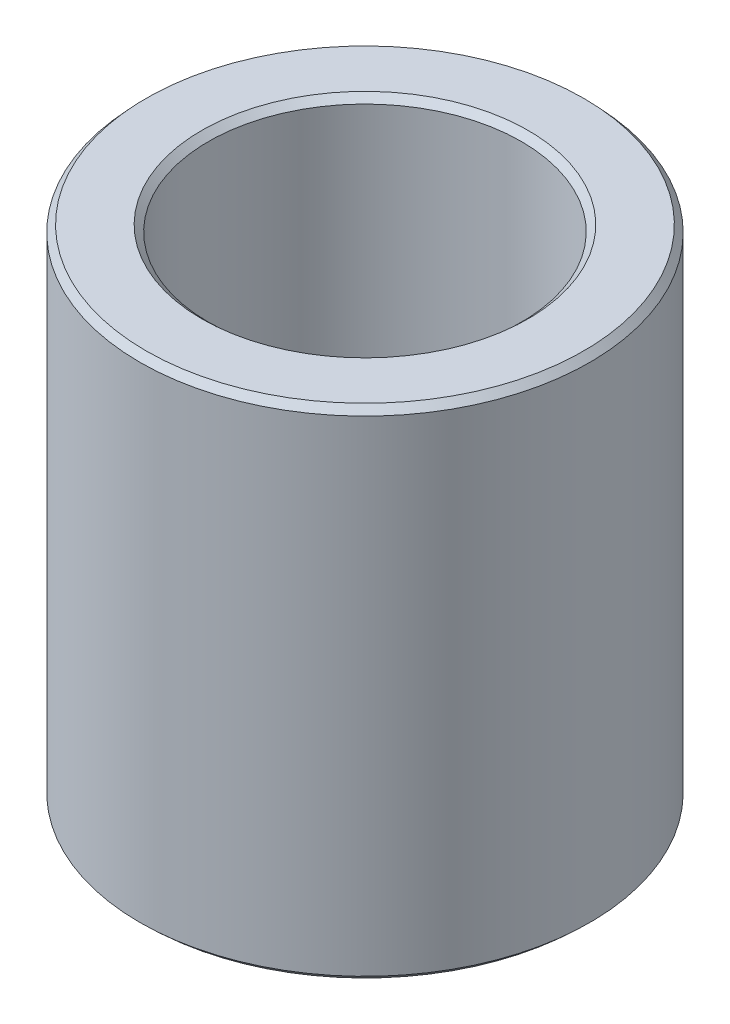
ISO-10303-21;
HEADER;
FILE_DESCRIPTION(('STEP AP214'),'2;1');
FILE_NAME('part.step','',(''),(''),'','','');
FILE_SCHEMA(('AUTOMOTIVE_DESIGN { 1 0 10303 214 1 1 1 1 }'));
ENDSEC;
DATA;
#1=APPLICATION_CONTEXT('core data for automotive mechanical design processes');
#2=APPLICATION_PROTOCOL_DEFINITION('international standard','automotive_design',2000,#1);
#3=PRODUCT_CONTEXT('',#1,'mechanical');
#4=PRODUCT('Part','Part','',(#3));
#5=PRODUCT_RELATED_PRODUCT_CATEGORY('part','',(#4));
#6=PRODUCT_DEFINITION_FORMATION('','',#4);
#7=PRODUCT_DEFINITION_CONTEXT('part definition',#1,'design');
#8=PRODUCT_DEFINITION('design','',#6,#7);
#9=PRODUCT_DEFINITION_SHAPE('','',#8);
#10=(LENGTH_UNIT() NAMED_UNIT(*) SI_UNIT(.MILLI.,.METRE.));
#11=(NAMED_UNIT(*) PLANE_ANGLE_UNIT() SI_UNIT($,.RADIAN.));
#12=(NAMED_UNIT(*) SI_UNIT($,.STERADIAN.) SOLID_ANGLE_UNIT());
#13=UNCERTAINTY_MEASURE_WITH_UNIT(LENGTH_MEASURE(1.E-05),#10,'distance_accuracy_value','');
#14=(GEOMETRIC_REPRESENTATION_CONTEXT(3) GLOBAL_UNCERTAINTY_ASSIGNED_CONTEXT((#13)) GLOBAL_UNIT_ASSIGNED_CONTEXT((#10,
#11,#12)) REPRESENTATION_CONTEXT('',''));
#15=CARTESIAN_POINT('',(0.,0.,0.));
#16=DIRECTION('',(0.,0.,1.));
#17=DIRECTION('',(1.,0.,0.));
#18=AXIS2_PLACEMENT_3D('',#15,#16,#17);
#19=CARTESIAN_POINT('',(0.,49.8068991668687,0.));
#20=DIRECTION('',(0.,-1.,0.));
#21=DIRECTION('',(0.,0.,-1.));
#22=AXIS2_PLACEMENT_3D('',#19,#20,#21);
#23=CYLINDRICAL_SURFACE('',#22,22.5);
#24=CARTESIAN_POINT('',(0.,0.622797454843664,0.));
#25=DIRECTION('',(0.,1.,0.));
#26=DIRECTION('',(0.,0.,1.));
#27=AXIS2_PLACEMENT_3D('',#24,#25,#26);
#28=CIRCLE('',#27,22.5);
#29=CARTESIAN_POINT('',(0.,0.622797454843664,22.5));
#30=VERTEX_POINT('',#29);
#31=EDGE_CURVE('E10',#30,#30,#28,.T.);
#32=ORIENTED_EDGE('',*,*,#31,.T.);
#33=EDGE_LOOP('',(#32));
#34=FACE_BOUND('',#33,.T.);
#35=CARTESIAN_POINT('',(0.,49.132414093952,0.));
#36=DIRECTION('',(0.,1.,0.));
#37=DIRECTION('',(0.,0.,1.));
#38=AXIS2_PLACEMENT_3D('',#35,#36,#37);
#39=CIRCLE('',#38,22.5);
#40=CARTESIAN_POINT('',(0.,49.132414093952,22.5));
#41=VERTEX_POINT('',#40);
#42=EDGE_CURVE('E50',#41,#41,#39,.F.);
#43=ORIENTED_EDGE('',*,*,#42,.T.);
#44=EDGE_LOOP('',(#43));
#45=FACE_BOUND('',#44,.T.);
#46=ADVANCED_FACE('F39',(#34,#45),#23,.T.);
#47=CARTESIAN_POINT('',(0.,49.8068991668687,0.));
#48=DIRECTION('',(0.,1.,0.));
#49=DIRECTION('',(0.,0.,1.));
#50=AXIS2_PLACEMENT_3D('',#47,#48,#49);
#51=PLANE('',#50);
#52=CARTESIAN_POINT('',(0.,49.8068991668687,0.));
#53=DIRECTION('',(0.,1.,0.));
#54=DIRECTION('',(0.,0.,1.));
#55=AXIS2_PLACEMENT_3D('',#52,#53,#54);
#56=CIRCLE('',#55,16.3207367449872);
#57=CARTESIAN_POINT('',(0.,49.8068991668687,16.3207367449872));
#58=VERTEX_POINT('',#57);
#59=EDGE_CURVE('E58',#58,#58,#56,.F.);
#60=ORIENTED_EDGE('',*,*,#59,.T.);
#61=EDGE_LOOP('',(#60));
#62=FACE_BOUND('',#61,.T.);
#63=CARTESIAN_POINT('',(0.,49.8068991668687,0.));
#64=DIRECTION('',(0.,1.,0.));
#65=DIRECTION('',(0.,0.,1.));
#66=AXIS2_PLACEMENT_3D('',#63,#64,#65);
#67=CIRCLE('',#66,21.8772025451563);
#68=CARTESIAN_POINT('',(0.,49.8068991668687,21.8772025451563));
#69=VERTEX_POINT('',#68);
#70=EDGE_CURVE('E61',#69,#69,#67,.T.);
#71=ORIENTED_EDGE('',*,*,#70,.T.);
#72=EDGE_LOOP('',(#71));
#73=FACE_BOUND('',#72,.T.);
#74=ADVANCED_FACE('F88',(#62,#73),#51,.T.);
#75=CARTESIAN_POINT('',(0.,0.,0.));
#76=DIRECTION('',(0.,1.,0.));
#77=DIRECTION('',(0.,0.,1.));
#78=AXIS2_PLACEMENT_3D('',#75,#76,#77);
#79=PLANE('',#78);
#80=CARTESIAN_POINT('',(0.,0.,0.));
#81=DIRECTION('',(0.,1.,0.));
#82=DIRECTION('',(0.,0.,1.));
#83=AXIS2_PLACEMENT_3D('',#80,#81,#82);
#84=CIRCLE('',#83,16.2690491269143);
#85=CARTESIAN_POINT('',(0.,0.,16.2690491269143));
#86=VERTEX_POINT('',#85);
#87=EDGE_CURVE('E51',#86,#86,#84,.T.);
#88=ORIENTED_EDGE('',*,*,#87,.T.);
#89=EDGE_LOOP('',(#88));
#90=FACE_BOUND('',#89,.T.);
#91=CARTESIAN_POINT('',(0.,0.,0.));
#92=DIRECTION('',(0.,1.,0.));
#93=DIRECTION('',(0.,0.,1.));
#94=AXIS2_PLACEMENT_3D('',#91,#92,#93);
#95=CIRCLE('',#94,21.8255149270834);
#96=CARTESIAN_POINT('',(0.,0.,21.8255149270834));
#97=VERTEX_POINT('',#96);
#98=EDGE_CURVE('E54',#97,#97,#95,.F.);
#99=ORIENTED_EDGE('',*,*,#98,.T.);
#100=EDGE_LOOP('',(#99));
#101=FACE_BOUND('',#100,.T.);
#102=ADVANCED_FACE('F83',(#90,#101),#79,.F.);
#103=CARTESIAN_POINT('',(0.,49.8068991668687,0.));
#104=DIRECTION('',(0.,-1.,0.));
#105=DIRECTION('',(0.,0.,-1.));
#106=AXIS2_PLACEMENT_3D('',#103,#104,#105);
#107=CYLINDRICAL_SURFACE('',#106,15.6462516720706);
#108=CARTESIAN_POINT('',(0.,49.184101712025,0.));
#109=DIRECTION('',(0.,1.,0.));
#110=DIRECTION('',(0.,0.,1.));
#111=AXIS2_PLACEMENT_3D('',#108,#109,#110);
#112=CIRCLE('',#111,15.6462516720706);
#113=CARTESIAN_POINT('',(0.,49.184101712025,15.6462516720706));
#114=VERTEX_POINT('',#113);
#115=EDGE_CURVE('E67',#114,#114,#112,.T.);
#116=ORIENTED_EDGE('',*,*,#115,.T.);
#117=EDGE_LOOP('',(#116));
#118=FACE_BOUND('',#117,.T.);
#119=CARTESIAN_POINT('',(0.,0.674485072916647,0.));
#120=DIRECTION('',(0.,1.,0.));
#121=DIRECTION('',(0.,0.,1.));
#122=AXIS2_PLACEMENT_3D('',#119,#120,#121);
#123=CIRCLE('',#122,15.6462516720706);
#124=CARTESIAN_POINT('',(0.,0.674485072916647,15.6462516720706));
#125=VERTEX_POINT('',#124);
#126=EDGE_CURVE('E69',#125,#125,#123,.F.);
#127=ORIENTED_EDGE('',*,*,#126,.T.);
#128=EDGE_LOOP('',(#127));
#129=FACE_BOUND('',#128,.T.);
#130=ADVANCED_FACE('F71',(#118,#129),#107,.F.);
#131=CARTESIAN_POINT('',(0.,49.184101712025,0.));
#132=DIRECTION('',(0.,1.,0.));
#133=DIRECTION('',(0.,0.,1.));
#134=AXIS2_PLACEMENT_3D('',#131,#132,#133);
#135=CONICAL_SURFACE('',#134,15.6462516720706,0.825220092887547);
#136=ORIENTED_EDGE('',*,*,#59,.F.);
#137=EDGE_LOOP('',(#136));
#138=FACE_BOUND('',#137,.T.);
#139=ORIENTED_EDGE('',*,*,#115,.F.);
#140=EDGE_LOOP('',(#139));
#141=FACE_BOUND('',#140,.T.);
#142=ADVANCED_FACE('F77',(#138,#141),#135,.F.);
#143=CARTESIAN_POINT('',(0.,0.,0.));
#144=DIRECTION('',(0.,-1.,0.));
#145=DIRECTION('',(0.,0.,-1.));
#146=AXIS2_PLACEMENT_3D('',#143,#144,#145);
#147=CONICAL_SURFACE('',#146,16.2690491269143,0.745576233907349);
#148=ORIENTED_EDGE('',*,*,#126,.F.);
#149=EDGE_LOOP('',(#148));
#150=FACE_BOUND('',#149,.T.);
#151=ORIENTED_EDGE('',*,*,#87,.F.);
#152=EDGE_LOOP('',(#151));
#153=FACE_BOUND('',#152,.T.);
#154=ADVANCED_FACE('F73',(#150,#153),#147,.F.);
#155=CARTESIAN_POINT('',(0.,0.622797454843664,0.));
#156=DIRECTION('',(0.,1.,0.));
#157=DIRECTION('',(0.,0.,1.));
#158=AXIS2_PLACEMENT_3D('',#155,#156,#157);
#159=CONICAL_SURFACE('',#158,22.5,0.825220092887553);
#160=ORIENTED_EDGE('',*,*,#98,.F.);
#161=EDGE_LOOP('',(#160));
#162=FACE_BOUND('',#161,.T.);
#163=ORIENTED_EDGE('',*,*,#31,.F.);
#164=EDGE_LOOP('',(#163));
#165=FACE_BOUND('',#164,.T.);
#166=ADVANCED_FACE('F76',(#162,#165),#159,.T.);
#167=CARTESIAN_POINT('',(0.,49.8068991668687,0.));
#168=DIRECTION('',(0.,-1.,0.));
#169=DIRECTION('',(0.,0.,-1.));
#170=AXIS2_PLACEMENT_3D('',#167,#168,#169);
#171=CONICAL_SURFACE('',#170,21.8772025451563,0.745576233907344);
#172=ORIENTED_EDGE('',*,*,#42,.F.);
#173=EDGE_LOOP('',(#172));
#174=FACE_BOUND('',#173,.T.);
#175=ORIENTED_EDGE('',*,*,#70,.F.);
#176=EDGE_LOOP('',(#175));
#177=FACE_BOUND('',#176,.T.);
#178=ADVANCED_FACE('F45',(#174,#177),#171,.T.);
#179=CLOSED_SHELL('',(#46,#74,#102,#130,#142,#154,#166,#178));
#180=MANIFOLD_SOLID_BREP('B2',#179);
#181=ADVANCED_BREP_SHAPE_REPRESENTATION('',(#18,#180),#14);
#182=SHAPE_DEFINITION_REPRESENTATION(#9,#181);
ENDSEC;
END-ISO-10303-21;
